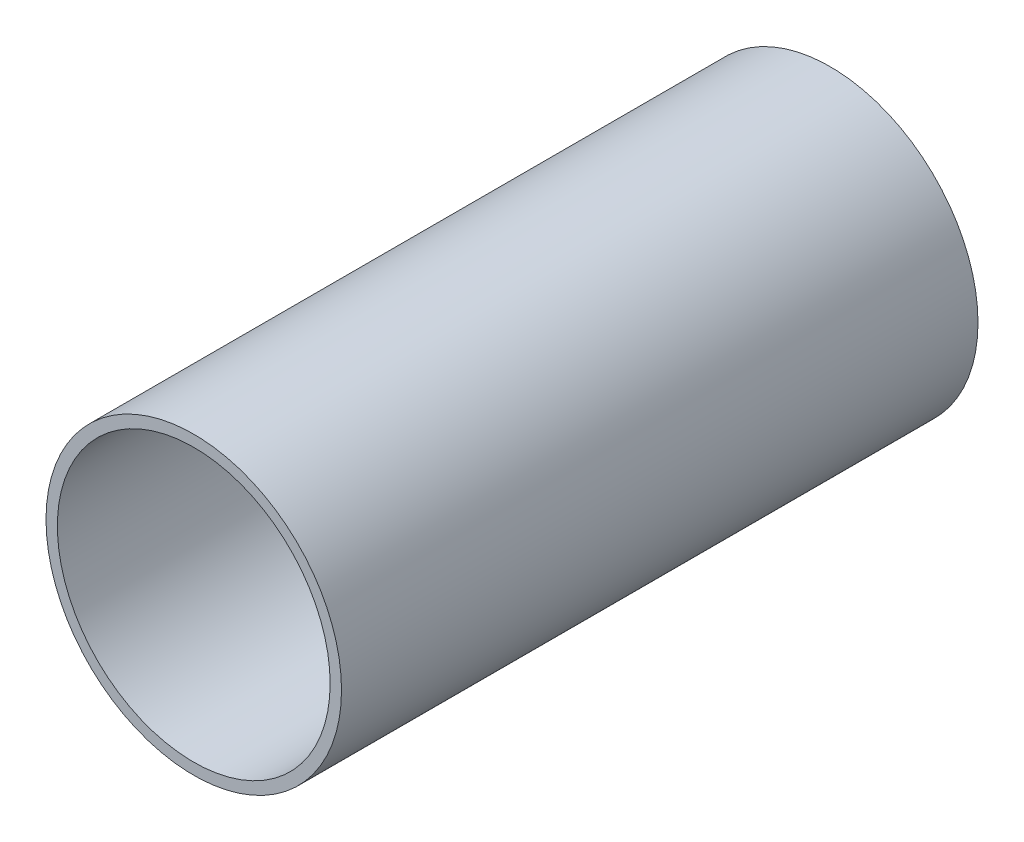
ISO-10303-21;
HEADER;
FILE_DESCRIPTION(('STEP AP214'),'2;1');
FILE_NAME('part.step','',(''),(''),'','','');
FILE_SCHEMA(('AUTOMOTIVE_DESIGN { 1 0 10303 214 1 1 1 1 }'));
ENDSEC;
DATA;
#1=APPLICATION_CONTEXT('core data for automotive mechanical design processes');
#2=APPLICATION_PROTOCOL_DEFINITION('international standard','automotive_design',2000,#1);
#3=PRODUCT_CONTEXT('',#1,'mechanical');
#4=PRODUCT('Part','Part','',(#3));
#5=PRODUCT_RELATED_PRODUCT_CATEGORY('part','',(#4));
#6=PRODUCT_DEFINITION_FORMATION('','',#4);
#7=PRODUCT_DEFINITION_CONTEXT('part definition',#1,'design');
#8=PRODUCT_DEFINITION('design','',#6,#7);
#9=PRODUCT_DEFINITION_SHAPE('','',#8);
#10=(LENGTH_UNIT() NAMED_UNIT(*) SI_UNIT(.MILLI.,.METRE.));
#11=(NAMED_UNIT(*) PLANE_ANGLE_UNIT() SI_UNIT($,.RADIAN.));
#12=(NAMED_UNIT(*) SI_UNIT($,.STERADIAN.) SOLID_ANGLE_UNIT());
#13=UNCERTAINTY_MEASURE_WITH_UNIT(LENGTH_MEASURE(1.E-05),#10,'distance_accuracy_value','');
#14=(GEOMETRIC_REPRESENTATION_CONTEXT(3) GLOBAL_UNCERTAINTY_ASSIGNED_CONTEXT((#13)) GLOBAL_UNIT_ASSIGNED_CONTEXT((#10,
#11,#12)) REPRESENTATION_CONTEXT('',''));
#15=CARTESIAN_POINT('',(0.,0.,0.));
#16=DIRECTION('',(0.,0.,1.));
#17=DIRECTION('',(1.,0.,0.));
#18=AXIS2_PLACEMENT_3D('',#15,#16,#17);
#19=CARTESIAN_POINT('',(0.,0.,177.8));
#20=DIRECTION('',(0.,0.,1.));
#21=DIRECTION('',(1.,0.,0.));
#22=AXIS2_PLACEMENT_3D('',#19,#20,#21);
#23=PLANE('',#22);
#24=CARTESIAN_POINT('',(0.,0.,177.8));
#25=DIRECTION('',(0.,0.,1.));
#26=DIRECTION('',(1.,0.,0.));
#27=AXIS2_PLACEMENT_3D('',#24,#25,#26);
#28=CIRCLE('',#27,41.275);
#29=CARTESIAN_POINT('',(41.275,0.,177.8));
#30=VERTEX_POINT('',#29);
#31=EDGE_CURVE('E10',#30,#30,#28,.T.);
#32=ORIENTED_EDGE('',*,*,#31,.T.);
#33=EDGE_LOOP('',(#32));
#34=FACE_BOUND('',#33,.T.);
#35=CARTESIAN_POINT('',(0.,0.,177.8));
#36=DIRECTION('',(0.,0.,1.));
#37=DIRECTION('',(1.,0.,0.));
#38=AXIS2_PLACEMENT_3D('',#35,#36,#37);
#39=CIRCLE('',#38,38.1);
#40=CARTESIAN_POINT('',(38.1,0.,177.8));
#41=VERTEX_POINT('',#40);
#42=EDGE_CURVE('E42',#41,#41,#39,.T.);
#43=ORIENTED_EDGE('',*,*,#42,.F.);
#44=EDGE_LOOP('',(#43));
#45=FACE_BOUND('',#44,.T.);
#46=ADVANCED_FACE('F31',(#34,#45),#23,.T.);
#47=CARTESIAN_POINT('',(0.,0.,0.));
#48=DIRECTION('',(0.,0.,1.));
#49=DIRECTION('',(1.,0.,0.));
#50=AXIS2_PLACEMENT_3D('',#47,#48,#49);
#51=PLANE('',#50);
#52=CARTESIAN_POINT('',(0.,0.,0.));
#53=DIRECTION('',(0.,0.,1.));
#54=DIRECTION('',(1.,0.,0.));
#55=AXIS2_PLACEMENT_3D('',#52,#53,#54);
#56=CIRCLE('',#55,41.275);
#57=CARTESIAN_POINT('',(41.275,0.,0.));
#58=VERTEX_POINT('',#57);
#59=EDGE_CURVE('E35',#58,#58,#56,.T.);
#60=ORIENTED_EDGE('',*,*,#59,.F.);
#61=EDGE_LOOP('',(#60));
#62=FACE_BOUND('',#61,.T.);
#63=CARTESIAN_POINT('',(0.,0.,0.));
#64=DIRECTION('',(0.,0.,1.));
#65=DIRECTION('',(1.,0.,0.));
#66=AXIS2_PLACEMENT_3D('',#63,#64,#65);
#67=CIRCLE('',#66,38.1);
#68=CARTESIAN_POINT('',(38.1,0.,0.));
#69=VERTEX_POINT('',#68);
#70=EDGE_CURVE('E44',#69,#69,#67,.T.);
#71=ORIENTED_EDGE('',*,*,#70,.T.);
#72=EDGE_LOOP('',(#71));
#73=FACE_BOUND('',#72,.T.);
#74=ADVANCED_FACE('F54',(#62,#73),#51,.F.);
#75=CARTESIAN_POINT('',(0.,0.,177.8));
#76=DIRECTION('',(0.,0.,-1.));
#77=DIRECTION('',(-1.,0.,0.));
#78=AXIS2_PLACEMENT_3D('',#75,#76,#77);
#79=CYLINDRICAL_SURFACE('',#78,41.275);
#80=ORIENTED_EDGE('',*,*,#31,.F.);
#81=EDGE_LOOP('',(#80));
#82=FACE_BOUND('',#81,.T.);
#83=ORIENTED_EDGE('',*,*,#59,.T.);
#84=EDGE_LOOP('',(#83));
#85=FACE_BOUND('',#84,.T.);
#86=ADVANCED_FACE('F33',(#82,#85),#79,.T.);
#87=CARTESIAN_POINT('',(0.,0.,177.8));
#88=DIRECTION('',(0.,0.,-1.));
#89=DIRECTION('',(-1.,0.,0.));
#90=AXIS2_PLACEMENT_3D('',#87,#88,#89);
#91=CYLINDRICAL_SURFACE('',#90,38.1);
#92=ORIENTED_EDGE('',*,*,#42,.T.);
#93=EDGE_LOOP('',(#92));
#94=FACE_BOUND('',#93,.T.);
#95=ORIENTED_EDGE('',*,*,#70,.F.);
#96=EDGE_LOOP('',(#95));
#97=FACE_BOUND('',#96,.T.);
#98=ADVANCED_FACE('F50',(#94,#97),#91,.F.);
#99=CLOSED_SHELL('',(#46,#74,#86,#98));
#100=MANIFOLD_SOLID_BREP('B2',#99);
#101=ADVANCED_BREP_SHAPE_REPRESENTATION('',(#18,#100),#14);
#102=SHAPE_DEFINITION_REPRESENTATION(#9,#101);
ENDSEC;
END-ISO-10303-21;
